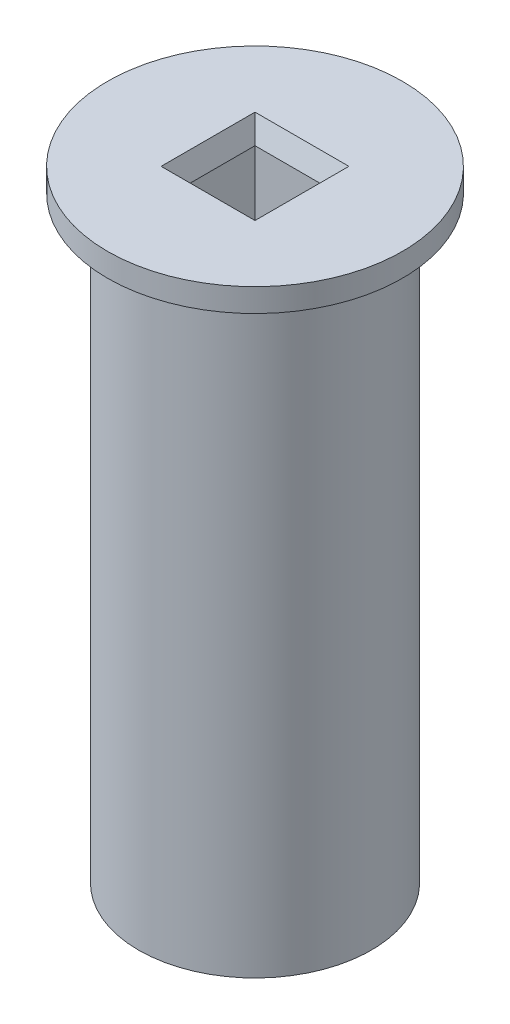
ISO-10303-21;
HEADER;
FILE_DESCRIPTION(('STEP AP214'),'2;1');
FILE_NAME('part.step','',(''),(''),'','','');
FILE_SCHEMA(('AUTOMOTIVE_DESIGN { 1 0 10303 214 1 1 1 1 }'));
ENDSEC;
DATA;
#1=APPLICATION_CONTEXT('core data for automotive mechanical design processes');
#2=APPLICATION_PROTOCOL_DEFINITION('international standard','automotive_design',2000,#1);
#3=PRODUCT_CONTEXT('',#1,'mechanical');
#4=PRODUCT('Part','Part','',(#3));
#5=PRODUCT_RELATED_PRODUCT_CATEGORY('part','',(#4));
#6=PRODUCT_DEFINITION_FORMATION('','',#4);
#7=PRODUCT_DEFINITION_CONTEXT('part definition',#1,'design');
#8=PRODUCT_DEFINITION('design','',#6,#7);
#9=PRODUCT_DEFINITION_SHAPE('','',#8);
#10=(LENGTH_UNIT() NAMED_UNIT(*) SI_UNIT(.MILLI.,.METRE.));
#11=(NAMED_UNIT(*) PLANE_ANGLE_UNIT() SI_UNIT($,.RADIAN.));
#12=(NAMED_UNIT(*) SI_UNIT($,.STERADIAN.) SOLID_ANGLE_UNIT());
#13=UNCERTAINTY_MEASURE_WITH_UNIT(LENGTH_MEASURE(1.E-05),#10,'distance_accuracy_value','');
#14=(GEOMETRIC_REPRESENTATION_CONTEXT(3) GLOBAL_UNCERTAINTY_ASSIGNED_CONTEXT((#13)) GLOBAL_UNIT_ASSIGNED_CONTEXT((#10,
#11,#12)) REPRESENTATION_CONTEXT('',''));
#15=CARTESIAN_POINT('',(0.,0.,0.));
#16=DIRECTION('',(0.,0.,1.));
#17=DIRECTION('',(1.,0.,0.));
#18=AXIS2_PLACEMENT_3D('',#15,#16,#17);
#19=CARTESIAN_POINT('',(0.,80.,0.));
#20=DIRECTION('',(0.,-1.,0.));
#21=DIRECTION('',(0.,0.,-1.));
#22=AXIS2_PLACEMENT_3D('',#19,#20,#21);
#23=CYLINDRICAL_SURFACE('',#22,15.);
#24=CARTESIAN_POINT('',(0.,0.,0.));
#25=DIRECTION('',(0.,1.,0.));
#26=DIRECTION('',(0.,0.,1.));
#27=AXIS2_PLACEMENT_3D('',#24,#25,#26);
#28=CIRCLE('',#27,15.);
#29=CARTESIAN_POINT('',(0.,0.,15.));
#30=VERTEX_POINT('',#29);
#31=EDGE_CURVE('E94',#30,#30,#28,.T.);
#32=ORIENTED_EDGE('',*,*,#31,.T.);
#33=EDGE_LOOP('',(#32));
#34=FACE_BOUND('',#33,.T.);
#35=CARTESIAN_POINT('',(0.,77.,0.));
#36=DIRECTION('',(0.,1.,0.));
#37=DIRECTION('',(0.,0.,1.));
#38=AXIS2_PLACEMENT_3D('',#35,#36,#37);
#39=CIRCLE('',#38,15.);
#40=CARTESIAN_POINT('',(0.,77.,15.));
#41=VERTEX_POINT('',#40);
#42=EDGE_CURVE('E115',#41,#41,#39,.T.);
#43=ORIENTED_EDGE('',*,*,#42,.F.);
#44=EDGE_LOOP('',(#43));
#45=FACE_BOUND('',#44,.T.);
#46=ADVANCED_FACE('F35',(#34,#45),#23,.T.);
#47=CARTESIAN_POINT('',(0.,80.,0.));
#48=DIRECTION('',(0.,1.,0.));
#49=DIRECTION('',(0.,0.,1.));
#50=AXIS2_PLACEMENT_3D('',#47,#48,#49);
#51=PLANE('',#50);
#52=DIRECTION('',(1.,0.,0.));
#53=VECTOR('',#52,1.);
#54=CARTESIAN_POINT('',(0.,80.,-6.05));
#55=LINE('',#54,#53);
#56=CARTESIAN_POINT('',(-6.05,80.,-6.05));
#57=VERTEX_POINT('',#56);
#58=CARTESIAN_POINT('',(6.05,80.,-6.05));
#59=VERTEX_POINT('',#58);
#60=EDGE_CURVE('E130',#57,#59,#55,.T.);
#61=ORIENTED_EDGE('',*,*,#60,.T.);
#62=DIRECTION('',(0.,0.,1.));
#63=VECTOR('',#62,1.);
#64=CARTESIAN_POINT('',(6.05,80.,0.));
#65=LINE('',#64,#63);
#66=CARTESIAN_POINT('',(6.05,80.,6.05));
#67=VERTEX_POINT('',#66);
#68=EDGE_CURVE('E136',#59,#67,#65,.T.);
#69=ORIENTED_EDGE('',*,*,#68,.T.);
#70=DIRECTION('',(-1.,0.,0.));
#71=VECTOR('',#70,1.);
#72=CARTESIAN_POINT('',(0.,80.,6.05));
#73=LINE('',#72,#71);
#74=CARTESIAN_POINT('',(-6.05,80.,6.05));
#75=VERTEX_POINT('',#74);
#76=EDGE_CURVE('E134',#67,#75,#73,.T.);
#77=ORIENTED_EDGE('',*,*,#76,.T.);
#78=DIRECTION('',(0.,0.,-1.));
#79=VECTOR('',#78,1.);
#80=CARTESIAN_POINT('',(-6.05,80.,0.));
#81=LINE('',#80,#79);
#82=EDGE_CURVE('E132',#75,#57,#81,.T.);
#83=ORIENTED_EDGE('',*,*,#82,.T.);
#84=EDGE_LOOP('',(#61,#69,#77,#83));
#85=FACE_BOUND('',#84,.T.);
#86=CARTESIAN_POINT('',(0.,80.,0.));
#87=DIRECTION('',(0.,1.,0.));
#88=DIRECTION('',(0.,0.,1.));
#89=AXIS2_PLACEMENT_3D('',#86,#87,#88);
#90=CIRCLE('',#89,19.);
#91=CARTESIAN_POINT('',(0.,80.,19.));
#92=VERTEX_POINT('',#91);
#93=EDGE_CURVE('E112',#92,#92,#90,.T.);
#94=ORIENTED_EDGE('',*,*,#93,.T.);
#95=EDGE_LOOP('',(#94));
#96=FACE_BOUND('',#95,.T.);
#97=ADVANCED_FACE('F157',(#85,#96),#51,.T.);
#98=CARTESIAN_POINT('',(0.,0.,0.));
#99=DIRECTION('',(0.,1.,0.));
#100=DIRECTION('',(0.,0.,1.));
#101=AXIS2_PLACEMENT_3D('',#98,#99,#100);
#102=PLANE('',#101);
#103=ORIENTED_EDGE('',*,*,#31,.F.);
#104=EDGE_LOOP('',(#103));
#105=FACE_BOUND('',#104,.T.);
#106=DIRECTION('',(0.,0.,1.));
#107=VECTOR('',#106,1.);
#108=CARTESIAN_POINT('',(-5.05,0.,5.05));
#109=LINE('',#108,#107);
#110=CARTESIAN_POINT('',(-5.05,0.,-5.05));
#111=VERTEX_POINT('',#110);
#112=CARTESIAN_POINT('',(-5.05,0.,5.05));
#113=VERTEX_POINT('',#112);
#114=EDGE_CURVE('E90',#111,#113,#109,.T.);
#115=ORIENTED_EDGE('',*,*,#114,.T.);
#116=DIRECTION('',(1.,0.,0.));
#117=VECTOR('',#116,1.);
#118=CARTESIAN_POINT('',(5.05,0.,5.05));
#119=LINE('',#118,#117);
#120=CARTESIAN_POINT('',(5.05,0.,5.05));
#121=VERTEX_POINT('',#120);
#122=EDGE_CURVE('E98',#113,#121,#119,.T.);
#123=ORIENTED_EDGE('',*,*,#122,.T.);
#124=DIRECTION('',(0.,0.,-1.));
#125=VECTOR('',#124,1.);
#126=CARTESIAN_POINT('',(5.05,0.,5.05));
#127=LINE('',#126,#125);
#128=CARTESIAN_POINT('',(5.05,0.,-5.05));
#129=VERTEX_POINT('',#128);
#130=EDGE_CURVE('E104',#121,#129,#127,.T.);
#131=ORIENTED_EDGE('',*,*,#130,.T.);
#132=DIRECTION('',(-1.,0.,0.));
#133=VECTOR('',#132,1.);
#134=CARTESIAN_POINT('',(5.05,0.,-5.05));
#135=LINE('',#134,#133);
#136=EDGE_CURVE('E108',#129,#111,#135,.T.);
#137=ORIENTED_EDGE('',*,*,#136,.T.);
#138=EDGE_LOOP('',(#115,#123,#131,#137));
#139=FACE_BOUND('',#138,.T.);
#140=ADVANCED_FACE('F106',(#105,#139),#102,.F.);
#141=CARTESIAN_POINT('',(-5.05,80.,5.05));
#142=DIRECTION('',(1.,0.,0.));
#143=DIRECTION('',(0.,0.,-1.));
#144=AXIS2_PLACEMENT_3D('',#141,#142,#143);
#145=PLANE('',#144);
#146=DIRECTION('',(0.,-1.,0.));
#147=VECTOR('',#146,1.);
#148=CARTESIAN_POINT('',(-5.05,80.,-5.05));
#149=LINE('',#148,#147);
#150=CARTESIAN_POINT('',(-5.05,77.2525225805453,-5.05));
#151=VERTEX_POINT('',#150);
#152=EDGE_CURVE('E120',#151,#111,#149,.T.);
#153=ORIENTED_EDGE('',*,*,#152,.F.);
#154=DIRECTION('',(0.,0.,1.));
#155=VECTOR('',#154,1.);
#156=CARTESIAN_POINT('',(-5.05,77.2525225805453,5.05));
#157=LINE('',#156,#155);
#158=CARTESIAN_POINT('',(-5.05,77.2525225805453,5.05));
#159=VERTEX_POINT('',#158);
#160=EDGE_CURVE('E44',#151,#159,#157,.T.);
#161=ORIENTED_EDGE('',*,*,#160,.T.);
#162=DIRECTION('',(0.,-1.,0.));
#163=VECTOR('',#162,1.);
#164=CARTESIAN_POINT('',(-5.05,80.,5.05));
#165=LINE('',#164,#163);
#166=EDGE_CURVE('E86',#159,#113,#165,.T.);
#167=ORIENTED_EDGE('',*,*,#166,.T.);
#168=ORIENTED_EDGE('',*,*,#114,.F.);
#169=EDGE_LOOP('',(#153,#161,#167,#168));
#170=FACE_BOUND('',#169,.T.);
#171=ADVANCED_FACE('F88',(#170),#145,.T.);
#172=CARTESIAN_POINT('',(5.05,80.,5.05));
#173=DIRECTION('',(0.,0.,-1.));
#174=DIRECTION('',(-1.,0.,0.));
#175=AXIS2_PLACEMENT_3D('',#172,#173,#174);
#176=PLANE('',#175);
#177=ORIENTED_EDGE('',*,*,#166,.F.);
#178=DIRECTION('',(1.,0.,0.));
#179=VECTOR('',#178,1.);
#180=CARTESIAN_POINT('',(5.05,77.2525225805453,5.05));
#181=LINE('',#180,#179);
#182=CARTESIAN_POINT('',(5.05,77.2525225805453,5.05));
#183=VERTEX_POINT('',#182);
#184=EDGE_CURVE('E139',#159,#183,#181,.T.);
#185=ORIENTED_EDGE('',*,*,#184,.T.);
#186=DIRECTION('',(0.,-1.,0.));
#187=VECTOR('',#186,1.);
#188=CARTESIAN_POINT('',(5.05,80.,5.05));
#189=LINE('',#188,#187);
#190=EDGE_CURVE('E95',#183,#121,#189,.T.);
#191=ORIENTED_EDGE('',*,*,#190,.T.);
#192=ORIENTED_EDGE('',*,*,#122,.F.);
#193=EDGE_LOOP('',(#177,#185,#191,#192));
#194=FACE_BOUND('',#193,.T.);
#195=ADVANCED_FACE('F99',(#194),#176,.T.);
#196=CARTESIAN_POINT('',(5.05,80.,5.05));
#197=DIRECTION('',(-1.,0.,0.));
#198=DIRECTION('',(0.,0.,1.));
#199=AXIS2_PLACEMENT_3D('',#196,#197,#198);
#200=PLANE('',#199);
#201=ORIENTED_EDGE('',*,*,#190,.F.);
#202=DIRECTION('',(0.,0.,-1.));
#203=VECTOR('',#202,1.);
#204=CARTESIAN_POINT('',(5.05,77.2525225805453,5.05));
#205=LINE('',#204,#203);
#206=CARTESIAN_POINT('',(5.05,77.2525225805453,-5.05));
#207=VERTEX_POINT('',#206);
#208=EDGE_CURVE('E127',#183,#207,#205,.T.);
#209=ORIENTED_EDGE('',*,*,#208,.T.);
#210=DIRECTION('',(0.,-1.,0.));
#211=VECTOR('',#210,1.);
#212=CARTESIAN_POINT('',(5.05,80.,-5.05));
#213=LINE('',#212,#211);
#214=EDGE_CURVE('E122',#207,#129,#213,.T.);
#215=ORIENTED_EDGE('',*,*,#214,.T.);
#216=ORIENTED_EDGE('',*,*,#130,.F.);
#217=EDGE_LOOP('',(#201,#209,#215,#216));
#218=FACE_BOUND('',#217,.T.);
#219=ADVANCED_FACE('F246',(#218),#200,.T.);
#220=CARTESIAN_POINT('',(5.05,80.,-5.05));
#221=DIRECTION('',(0.,0.,1.));
#222=DIRECTION('',(1.,0.,0.));
#223=AXIS2_PLACEMENT_3D('',#220,#221,#222);
#224=PLANE('',#223);
#225=ORIENTED_EDGE('',*,*,#214,.F.);
#226=DIRECTION('',(-1.,0.,0.));
#227=VECTOR('',#226,1.);
#228=CARTESIAN_POINT('',(5.05,77.2525225805453,-5.05));
#229=LINE('',#228,#227);
#230=EDGE_CURVE('E11',#207,#151,#229,.T.);
#231=ORIENTED_EDGE('',*,*,#230,.T.);
#232=ORIENTED_EDGE('',*,*,#152,.T.);
#233=ORIENTED_EDGE('',*,*,#136,.F.);
#234=EDGE_LOOP('',(#225,#231,#232,#233));
#235=FACE_BOUND('',#234,.T.);
#236=ADVANCED_FACE('F170',(#235),#224,.T.);
#237=CARTESIAN_POINT('',(0.,77.,0.));
#238=DIRECTION('',(0.,1.,0.));
#239=DIRECTION('',(0.,0.,1.));
#240=AXIS2_PLACEMENT_3D('',#237,#238,#239);
#241=PLANE('',#240);
#242=CARTESIAN_POINT('',(0.,77.,0.));
#243=DIRECTION('',(0.,1.,0.));
#244=DIRECTION('',(0.,0.,1.));
#245=AXIS2_PLACEMENT_3D('',#242,#243,#244);
#246=CIRCLE('',#245,19.);
#247=CARTESIAN_POINT('',(0.,77.,19.));
#248=VERTEX_POINT('',#247);
#249=EDGE_CURVE('E109',#248,#248,#246,.T.);
#250=ORIENTED_EDGE('',*,*,#249,.F.);
#251=EDGE_LOOP('',(#250));
#252=FACE_BOUND('',#251,.T.);
#253=ORIENTED_EDGE('',*,*,#42,.T.);
#254=EDGE_LOOP('',(#253));
#255=FACE_BOUND('',#254,.T.);
#256=ADVANCED_FACE('F161',(#252,#255),#241,.F.);
#257=CARTESIAN_POINT('',(0.,77.,0.));
#258=DIRECTION('',(0.,1.,0.));
#259=DIRECTION('',(0.,0.,1.));
#260=AXIS2_PLACEMENT_3D('',#257,#258,#259);
#261=CYLINDRICAL_SURFACE('',#260,19.);
#262=ORIENTED_EDGE('',*,*,#249,.T.);
#263=EDGE_LOOP('',(#262));
#264=FACE_BOUND('',#263,.T.);
#265=ORIENTED_EDGE('',*,*,#93,.F.);
#266=EDGE_LOOP('',(#265));
#267=FACE_BOUND('',#266,.T.);
#268=ADVANCED_FACE('F159',(#264,#267),#261,.T.);
#269=CARTESIAN_POINT('',(-5.05,77.2525225805453,5.05));
#270=DIRECTION('',(-0.939692620785909,-0.342020143325666,0.));
#271=DIRECTION('',(0.,0.,1.));
#272=AXIS2_PLACEMENT_3D('',#269,#270,#271);
#273=PLANE('',#272);
#274=DIRECTION('',(0.323615577118182,-0.88912649071599,0.323615577118182));
#275=VECTOR('',#274,1.);
#276=CARTESIAN_POINT('',(-3.9922568782893,74.3463972380617,-3.9922568782893));
#277=LINE('',#276,#275);
#278=EDGE_CURVE('E145',#57,#151,#277,.T.);
#279=ORIENTED_EDGE('',*,*,#278,.F.);
#280=ORIENTED_EDGE('',*,*,#82,.F.);
#281=DIRECTION('',(0.323615577118182,-0.88912649071599,-0.323615577118183));
#282=VECTOR('',#281,1.);
#283=CARTESIAN_POINT('',(-3.9922568782893,74.3463972380617,3.9922568782893));
#284=LINE('',#283,#282);
#285=EDGE_CURVE('E39',#159,#75,#284,.F.);
#286=ORIENTED_EDGE('',*,*,#285,.F.);
#287=ORIENTED_EDGE('',*,*,#160,.F.);
#288=EDGE_LOOP('',(#279,#280,#286,#287));
#289=FACE_BOUND('',#288,.T.);
#290=ADVANCED_FACE('F37',(#289),#273,.F.);
#291=CARTESIAN_POINT('',(5.05,77.2525225805453,5.05));
#292=DIRECTION('',(0.,-0.342020143325666,0.939692620785909));
#293=DIRECTION('',(1.,0.,0.));
#294=AXIS2_PLACEMENT_3D('',#291,#292,#293);
#295=PLANE('',#294);
#296=ORIENTED_EDGE('',*,*,#285,.T.);
#297=ORIENTED_EDGE('',*,*,#76,.F.);
#298=DIRECTION('',(-0.323615577118182,-0.88912649071599,-0.323615577118183));
#299=VECTOR('',#298,1.);
#300=CARTESIAN_POINT('',(5.05,77.2525225805453,5.05));
#301=LINE('',#300,#299);
#302=EDGE_CURVE('E144',#183,#67,#301,.F.);
#303=ORIENTED_EDGE('',*,*,#302,.F.);
#304=ORIENTED_EDGE('',*,*,#184,.F.);
#305=EDGE_LOOP('',(#296,#297,#303,#304));
#306=FACE_BOUND('',#305,.T.);
#307=ADVANCED_FACE('F168',(#306),#295,.F.);
#308=CARTESIAN_POINT('',(5.05,77.2525225805453,-5.05));
#309=DIRECTION('',(0.,-0.342020143325666,-0.939692620785909));
#310=DIRECTION('',(-1.,0.,0.));
#311=AXIS2_PLACEMENT_3D('',#308,#309,#310);
#312=PLANE('',#311);
#313=ORIENTED_EDGE('',*,*,#278,.T.);
#314=ORIENTED_EDGE('',*,*,#230,.F.);
#315=DIRECTION('',(0.323615577118182,0.88912649071599,-0.323615577118182));
#316=VECTOR('',#315,1.);
#317=CARTESIAN_POINT('',(3.9922568782893,74.3463972380617,-3.9922568782893));
#318=LINE('',#317,#316);
#319=EDGE_CURVE('E142',#59,#207,#318,.F.);
#320=ORIENTED_EDGE('',*,*,#319,.F.);
#321=ORIENTED_EDGE('',*,*,#60,.F.);
#322=EDGE_LOOP('',(#313,#314,#320,#321));
#323=FACE_BOUND('',#322,.T.);
#324=ADVANCED_FACE('F188',(#323),#312,.F.);
#325=CARTESIAN_POINT('',(5.05,77.2525225805453,5.05));
#326=DIRECTION('',(0.939692620785909,-0.342020143325666,0.));
#327=DIRECTION('',(0.,0.,-1.));
#328=AXIS2_PLACEMENT_3D('',#325,#326,#327);
#329=PLANE('',#328);
#330=ORIENTED_EDGE('',*,*,#302,.T.);
#331=ORIENTED_EDGE('',*,*,#68,.F.);
#332=ORIENTED_EDGE('',*,*,#319,.T.);
#333=ORIENTED_EDGE('',*,*,#208,.F.);
#334=EDGE_LOOP('',(#330,#331,#332,#333));
#335=FACE_BOUND('',#334,.T.);
#336=ADVANCED_FACE('F185',(#335),#329,.F.);
#337=CLOSED_SHELL('',(#46,#97,#140,#171,#195,#219,#236,#256,#268,#290,#307,#324,#336));
#338=MANIFOLD_SOLID_BREP('B2',#337);
#339=ADVANCED_BREP_SHAPE_REPRESENTATION('',(#18,#338),#14);
#340=SHAPE_DEFINITION_REPRESENTATION(#9,#339);
ENDSEC;
END-ISO-10303-21;
